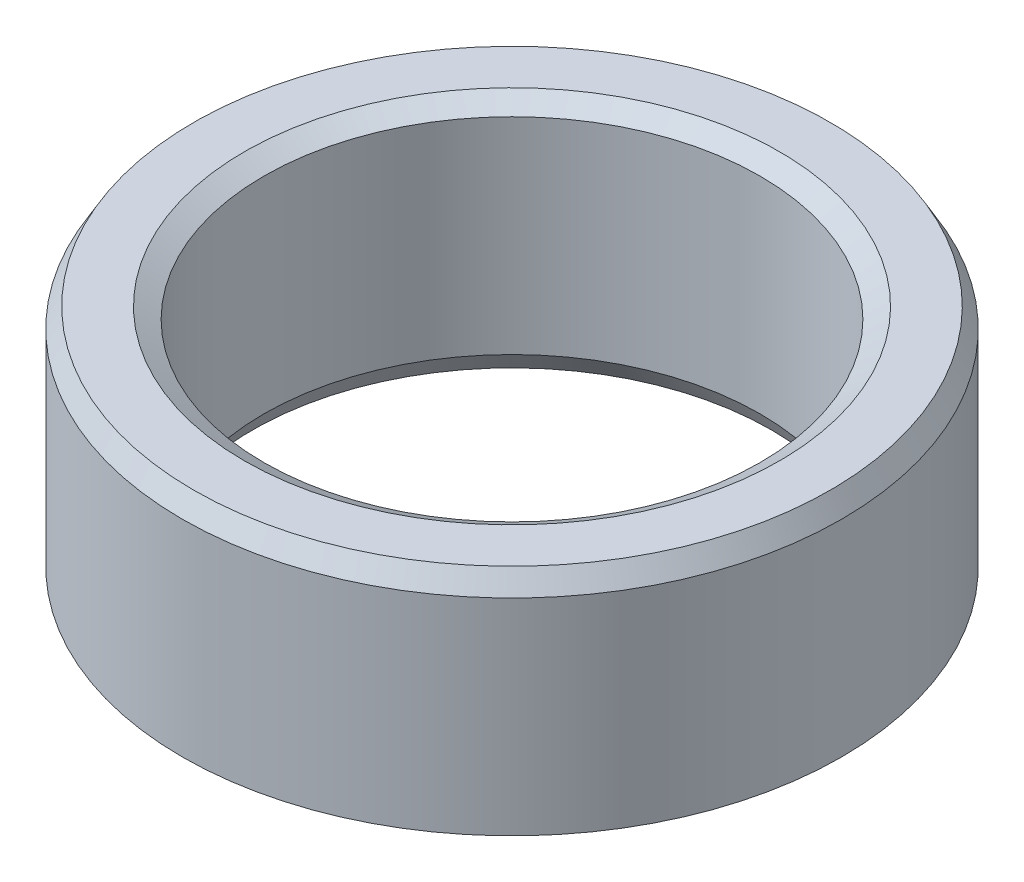
ISO-10303-21;
HEADER;
FILE_DESCRIPTION(('STEP AP214'),'2;1');
FILE_NAME('part.step','',(''),(''),'','','');
FILE_SCHEMA(('AUTOMOTIVE_DESIGN { 1 0 10303 214 1 1 1 1 }'));
ENDSEC;
DATA;
#1=APPLICATION_CONTEXT('core data for automotive mechanical design processes');
#2=APPLICATION_PROTOCOL_DEFINITION('international standard','automotive_design',2000,#1);
#3=PRODUCT_CONTEXT('',#1,'mechanical');
#4=PRODUCT('Part','Part','',(#3));
#5=PRODUCT_RELATED_PRODUCT_CATEGORY('part','',(#4));
#6=PRODUCT_DEFINITION_FORMATION('','',#4);
#7=PRODUCT_DEFINITION_CONTEXT('part definition',#1,'design');
#8=PRODUCT_DEFINITION('design','',#6,#7);
#9=PRODUCT_DEFINITION_SHAPE('','',#8);
#10=(LENGTH_UNIT() NAMED_UNIT(*) SI_UNIT(.MILLI.,.METRE.));
#11=(NAMED_UNIT(*) PLANE_ANGLE_UNIT() SI_UNIT($,.RADIAN.));
#12=(NAMED_UNIT(*) SI_UNIT($,.STERADIAN.) SOLID_ANGLE_UNIT());
#13=UNCERTAINTY_MEASURE_WITH_UNIT(LENGTH_MEASURE(1.E-05),#10,'distance_accuracy_value','');
#14=(GEOMETRIC_REPRESENTATION_CONTEXT(3) GLOBAL_UNCERTAINTY_ASSIGNED_CONTEXT((#13)) GLOBAL_UNIT_ASSIGNED_CONTEXT((#10,
#11,#12)) REPRESENTATION_CONTEXT('',''));
#15=CARTESIAN_POINT('',(0.,0.,0.));
#16=DIRECTION('',(0.,0.,1.));
#17=DIRECTION('',(1.,0.,0.));
#18=AXIS2_PLACEMENT_3D('',#15,#16,#17);
#19=CARTESIAN_POINT('',(0.,28.7259311377696,0.));
#20=DIRECTION('',(0.,-1.,0.));
#21=DIRECTION('',(0.,0.,-1.));
#22=AXIS2_PLACEMENT_3D('',#19,#20,#21);
#23=CYLINDRICAL_SURFACE('',#22,40.);
#24=CARTESIAN_POINT('',(0.,1.36964501173693,0.));
#25=DIRECTION('',(0.,1.,0.));
#26=DIRECTION('',(0.,0.,1.));
#27=AXIS2_PLACEMENT_3D('',#24,#25,#26);
#28=CIRCLE('',#27,40.);
#29=CARTESIAN_POINT('',(0.,1.36964501173693,40.));
#30=VERTEX_POINT('',#29);
#31=EDGE_CURVE('E10',#30,#30,#28,.T.);
#32=ORIENTED_EDGE('',*,*,#31,.T.);
#33=EDGE_LOOP('',(#32));
#34=FACE_BOUND('',#33,.T.);
#35=CARTESIAN_POINT('',(0.,26.3536363891079,0.));
#36=DIRECTION('',(0.,1.,0.));
#37=DIRECTION('',(0.,0.,1.));
#38=AXIS2_PLACEMENT_3D('',#35,#36,#37);
#39=CIRCLE('',#38,40.);
#40=CARTESIAN_POINT('',(0.,26.3536363891079,40.));
#41=VERTEX_POINT('',#40);
#42=EDGE_CURVE('E50',#41,#41,#39,.F.);
#43=ORIENTED_EDGE('',*,*,#42,.T.);
#44=EDGE_LOOP('',(#43));
#45=FACE_BOUND('',#44,.T.);
#46=ADVANCED_FACE('F39',(#34,#45),#23,.T.);
#47=CARTESIAN_POINT('',(0.,28.7259311377696,0.));
#48=DIRECTION('',(0.,1.,0.));
#49=DIRECTION('',(0.,0.,1.));
#50=AXIS2_PLACEMENT_3D('',#47,#48,#49);
#51=PLANE('',#50);
#52=CARTESIAN_POINT('',(0.,28.7259311377696,0.));
#53=DIRECTION('',(0.,1.,0.));
#54=DIRECTION('',(0.,0.,1.));
#55=AXIS2_PLACEMENT_3D('',#52,#53,#54);
#56=CIRCLE('',#55,32.4754508184925);
#57=CARTESIAN_POINT('',(0.,28.7259311377696,32.4754508184925));
#58=VERTEX_POINT('',#57);
#59=EDGE_CURVE('E58',#58,#58,#56,.F.);
#60=ORIENTED_EDGE('',*,*,#59,.T.);
#61=EDGE_LOOP('',(#60));
#62=FACE_BOUND('',#61,.T.);
#63=CARTESIAN_POINT('',(0.,28.7259311377696,0.));
#64=DIRECTION('',(0.,1.,0.));
#65=DIRECTION('',(0.,0.,1.));
#66=AXIS2_PLACEMENT_3D('',#63,#64,#65);
#67=CIRCLE('',#66,38.6303549882631);
#68=CARTESIAN_POINT('',(0.,28.7259311377696,38.6303549882631));
#69=VERTEX_POINT('',#68);
#70=EDGE_CURVE('E61',#69,#69,#67,.T.);
#71=ORIENTED_EDGE('',*,*,#70,.T.);
#72=EDGE_LOOP('',(#71));
#73=FACE_BOUND('',#72,.T.);
#74=ADVANCED_FACE('F88',(#62,#73),#51,.T.);
#75=CARTESIAN_POINT('',(0.,0.,0.));
#76=DIRECTION('',(0.,1.,0.));
#77=DIRECTION('',(0.,0.,1.));
#78=AXIS2_PLACEMENT_3D('',#75,#76,#77);
#79=PLANE('',#78);
#80=CARTESIAN_POINT('',(0.,0.,0.));
#81=DIRECTION('',(0.,1.,0.));
#82=DIRECTION('',(0.,0.,1.));
#83=AXIS2_PLACEMENT_3D('',#80,#81,#82);
#84=CIRCLE('',#83,31.4728010815678);
#85=CARTESIAN_POINT('',(0.,0.,31.4728010815678));
#86=VERTEX_POINT('',#85);
#87=EDGE_CURVE('E51',#86,#86,#84,.T.);
#88=ORIENTED_EDGE('',*,*,#87,.T.);
#89=EDGE_LOOP('',(#88));
#90=FACE_BOUND('',#89,.T.);
#91=CARTESIAN_POINT('',(0.,0.,0.));
#92=DIRECTION('',(0.,1.,0.));
#93=DIRECTION('',(0.,0.,1.));
#94=AXIS2_PLACEMENT_3D('',#91,#92,#93);
#95=CIRCLE('',#94,37.6277052513383);
#96=CARTESIAN_POINT('',(0.,0.,37.6277052513383));
#97=VERTEX_POINT('',#96);
#98=EDGE_CURVE('E54',#97,#97,#95,.F.);
#99=ORIENTED_EDGE('',*,*,#98,.T.);
#100=EDGE_LOOP('',(#99));
#101=FACE_BOUND('',#100,.T.);
#102=ADVANCED_FACE('F83',(#90,#101),#79,.F.);
#103=CARTESIAN_POINT('',(0.,28.7259311377696,0.));
#104=DIRECTION('',(0.,-1.,0.));
#105=DIRECTION('',(0.,0.,-1.));
#106=AXIS2_PLACEMENT_3D('',#103,#104,#105);
#107=CYLINDRICAL_SURFACE('',#106,30.1031560698308);
#108=CARTESIAN_POINT('',(0.,27.3562861260326,0.));
#109=DIRECTION('',(0.,1.,0.));
#110=DIRECTION('',(0.,0.,1.));
#111=AXIS2_PLACEMENT_3D('',#108,#109,#110);
#112=CIRCLE('',#111,30.1031560698308);
#113=CARTESIAN_POINT('',(0.,27.3562861260326,30.1031560698308));
#114=VERTEX_POINT('',#113);
#115=EDGE_CURVE('E67',#114,#114,#112,.T.);
#116=ORIENTED_EDGE('',*,*,#115,.T.);
#117=EDGE_LOOP('',(#116));
#118=FACE_BOUND('',#117,.T.);
#119=CARTESIAN_POINT('',(0.,2.37229474866171,0.));
#120=DIRECTION('',(0.,1.,0.));
#121=DIRECTION('',(0.,0.,1.));
#122=AXIS2_PLACEMENT_3D('',#119,#120,#121);
#123=CIRCLE('',#122,30.1031560698308);
#124=CARTESIAN_POINT('',(0.,2.37229474866171,30.1031560698308));
#125=VERTEX_POINT('',#124);
#126=EDGE_CURVE('E69',#125,#125,#123,.F.);
#127=ORIENTED_EDGE('',*,*,#126,.T.);
#128=EDGE_LOOP('',(#127));
#129=FACE_BOUND('',#128,.T.);
#130=ADVANCED_FACE('F71',(#118,#129),#107,.F.);
#131=CARTESIAN_POINT('',(0.,27.3562861260326,0.));
#132=DIRECTION('',(0.,1.,0.));
#133=DIRECTION('',(0.,0.,1.));
#134=AXIS2_PLACEMENT_3D('',#131,#132,#133);
#135=CONICAL_SURFACE('',#134,30.1031560698308,1.0471975511966);
#136=CARTESIAN_POINT('',(0.,28.7259311377696,32.4754508184925));
#137=CARTESIAN_POINT('',(0.,28.7116640022307,32.4507394148606));
#138=CARTESIAN_POINT('',(0.,28.6973968666918,32.4260280112288));
#139=CARTESIAN_POINT('',(0.,28.6688625956139,32.376605203965));
#140=CARTESIAN_POINT('',(0.,28.654595460075,32.3518938003331));
#141=CARTESIAN_POINT('',(0.,28.6260611889971,32.3024709930693));
#142=CARTESIAN_POINT('',(0.,28.6117940534582,32.2777595894374));
#143=CARTESIAN_POINT('',(0.,28.5832597823803,32.2283367821736));
#144=CARTESIAN_POINT('',(0.,28.5689926468414,32.2036253785417));
#145=CARTESIAN_POINT('',(0.,28.5404583757636,32.1542025712779));
#146=CARTESIAN_POINT('',(0.,28.5261912402246,32.129491167646));
#147=CARTESIAN_POINT('',(0.,28.4976569691468,32.0800683603822));
#148=CARTESIAN_POINT('',(0.,28.4833898336079,32.0553569567504));
#149=CARTESIAN_POINT('',(0.,28.45485556253,32.0059341494866));
#150=CARTESIAN_POINT('',(0.,28.4405884269911,31.9812227458547));
#151=CARTESIAN_POINT('',(0.,28.4120541559132,31.9317999385909));
#152=CARTESIAN_POINT('',(0.,28.3977870203743,31.907088534959));
#153=CARTESIAN_POINT('',(0.,28.3692527492964,31.8576657276952));
#154=CARTESIAN_POINT('',(0.,28.3549856137575,31.8329543240633));
#155=CARTESIAN_POINT('',(0.,28.3264513426797,31.7835315167995));
#156=CARTESIAN_POINT('',(0.,28.3121842071407,31.7588201131676));
#157=CARTESIAN_POINT('',(0.,28.2836499360629,31.7093973059039));
#158=CARTESIAN_POINT('',(0.,28.269382800524,31.684685902272));
#159=CARTESIAN_POINT('',(0.,28.2408485294461,31.6352630950082));
#160=CARTESIAN_POINT('',(0.,28.2265813939072,31.6105516913763));
#161=CARTESIAN_POINT('',(0.,28.1980471228293,31.5611288841125));
#162=CARTESIAN_POINT('',(0.,28.1837799872904,31.5364174804806));
#163=CARTESIAN_POINT('',(0.,28.1552457162125,31.4869946732168));
#164=CARTESIAN_POINT('',(0.,28.1409785806736,31.4622832695849));
#165=CARTESIAN_POINT('',(0.,28.1124443095958,31.4128604623211));
#166=CARTESIAN_POINT('',(0.,28.0981771740568,31.3881490586893));
#167=CARTESIAN_POINT('',(0.,28.069642902979,31.3387262514255));
#168=CARTESIAN_POINT('',(0.,28.0553757674401,31.3140148477936));
#169=CARTESIAN_POINT('',(0.,28.0268414963622,31.2645920405298));
#170=CARTESIAN_POINT('',(0.,28.0125743608233,31.2398806368979));
#171=CARTESIAN_POINT('',(0.,27.9840400897454,31.1904578296341));
#172=CARTESIAN_POINT('',(0.,27.9697729542065,31.1657464260022));
#173=CARTESIAN_POINT('',(0.,27.9412386831286,31.1163236187384));
#174=CARTESIAN_POINT('',(0.,27.9269715475897,31.0916122151065));
#175=CARTESIAN_POINT('',(0.,27.8984372765119,31.0421894078428));
#176=CARTESIAN_POINT('',(0.,27.8841701409729,31.0174780042109));
#177=CARTESIAN_POINT('',(0.,27.8556358698951,30.9680551969471));
#178=CARTESIAN_POINT('',(0.,27.8413687343562,30.9433437933152));
#179=CARTESIAN_POINT('',(0.,27.8128344632783,30.8939209860514));
#180=CARTESIAN_POINT('',(0.,27.7985673277394,30.8692095824195));
#181=CARTESIAN_POINT('',(0.,27.7700330566615,30.8197867751557));
#182=CARTESIAN_POINT('',(0.,27.7557659211226,30.7950753715238));
#183=CARTESIAN_POINT('',(0.,27.7272316500447,30.74565256426));
#184=CARTESIAN_POINT('',(0.,27.7129645145058,30.7209411606281));
#185=CARTESIAN_POINT('',(0.,27.684430243428,30.6715183533644));
#186=CARTESIAN_POINT('',(0.,27.670163107889,30.6468069497325));
#187=CARTESIAN_POINT('',(0.,27.6416288368112,30.5973841424687));
#188=CARTESIAN_POINT('',(0.,27.6273617012723,30.5726727388368));
#189=CARTESIAN_POINT('',(0.,27.5988274301944,30.523249931573));
#190=CARTESIAN_POINT('',(0.,27.5845602946555,30.4985385279411));
#191=CARTESIAN_POINT('',(0.,27.5560260235776,30.4491157206773));
#192=CARTESIAN_POINT('',(0.,27.5417588880387,30.4244043170454));
#193=CARTESIAN_POINT('',(0.,27.5132246169608,30.3749815097816));
#194=CARTESIAN_POINT('',(0.,27.4989574814219,30.3502701061498));
#195=CARTESIAN_POINT('',(0.,27.4704232103441,30.300847298886));
#196=CARTESIAN_POINT('',(0.,27.4561560748051,30.2761358952541));
#197=CARTESIAN_POINT('',(0.,27.4276218037273,30.2267130879903));
#198=CARTESIAN_POINT('',(0.,27.4133546681884,30.2020016843584));
#199=CARTESIAN_POINT('',(0.,27.3848203971105,30.1525788770946));
#200=CARTESIAN_POINT('',(0.,27.3705532615716,30.1278674734627));
#201=CARTESIAN_POINT('',(0.,27.3562861260326,30.1031560698308));
#202=B_SPLINE_CURVE_WITH_KNOTS('',3,(#136,#137,#138,#139,#140,#141,#142,#143,#144,#145,#146,
#147,#148,#149,#150,#151,#152,#153,#154,#155,#156,#157,#158,#159,#160,#161,#162,#163,#164,#165,
#166,#167,#168,#169,#170,#171,#172,#173,#174,#175,#176,#177,#178,#179,#180,#181,#182,#183,#184,
#185,#186,#187,#188,#189,#190,#191,#192,#193,#194,#195,#196,#197,#198,#199,#200,#201),
.UNSPECIFIED.,.F.,.F.,(4,2,2,2,2,2,2,2,2,2,2,2,2,2,2,2,2,2,2,2,2,2,2,2,2,2,2,2,2,2,2,2,4),(0.,
0.08560281323356,0.171205626467122,0.256808439700683,0.342411252934245,0.428014066167807,
0.513616879401367,0.599219692634923,0.684822505868484,0.770425319102046,0.856028132335608,
0.941630945569168,1.02723375880273,1.11283657203629,1.19843938526985,1.28404219850341,
1.36964501173697,1.45524782497053,1.54085063820409,1.62645345143765,1.71205626467121,
1.79765907790477,1.88326189113833,1.96886470437189,2.05446751760546,2.14007033083902,
2.22567314407258,2.31127595730614,2.3968787705397,2.48248158377326,2.56808439700682,
2.65368721024038,2.73929002347394),.UNSPECIFIED.);
#203=EDGE_CURVE('BSEAM77',#58,#114,#202,.T.);
#204=ORIENTED_EDGE('',*,*,#59,.F.);
#205=ORIENTED_EDGE('',*,*,#115,.F.);
#206=ORIENTED_EDGE('',*,*,#203,.T.);
#207=ORIENTED_EDGE('',*,*,#203,.F.);
#208=EDGE_LOOP('',(#204,#206,#205,#207));
#209=FACE_BOUND('',#208,.T.);
#210=ADVANCED_FACE('F77',(#209),#135,.F.);
#211=CARTESIAN_POINT('',(0.,0.,0.));
#212=DIRECTION('',(0.,-1.,0.));
#213=DIRECTION('',(0.,0.,-1.));
#214=AXIS2_PLACEMENT_3D('',#211,#212,#213);
#215=CONICAL_SURFACE('',#214,31.4728010815678,0.523598775598295);
#216=ORIENTED_EDGE('',*,*,#126,.F.);
#217=EDGE_LOOP('',(#216));
#218=FACE_BOUND('',#217,.T.);
#219=ORIENTED_EDGE('',*,*,#87,.F.);
#220=EDGE_LOOP('',(#219));
#221=FACE_BOUND('',#220,.T.);
#222=ADVANCED_FACE('F73',(#218,#221),#215,.F.);
#223=CARTESIAN_POINT('',(0.,1.36964501173693,0.));
#224=DIRECTION('',(0.,1.,0.));
#225=DIRECTION('',(0.,0.,1.));
#226=AXIS2_PLACEMENT_3D('',#223,#224,#225);
#227=CONICAL_SURFACE('',#226,40.,1.0471975511966);
#228=ORIENTED_EDGE('',*,*,#98,.F.);
#229=EDGE_LOOP('',(#228));
#230=FACE_BOUND('',#229,.T.);
#231=ORIENTED_EDGE('',*,*,#31,.F.);
#232=EDGE_LOOP('',(#231));
#233=FACE_BOUND('',#232,.T.);
#234=ADVANCED_FACE('F76',(#230,#233),#227,.T.);
#235=CARTESIAN_POINT('',(0.,28.7259311377696,0.));
#236=DIRECTION('',(0.,-1.,0.));
#237=DIRECTION('',(0.,0.,-1.));
#238=AXIS2_PLACEMENT_3D('',#235,#236,#237);
#239=CONICAL_SURFACE('',#238,38.6303549882631,0.5235987755983);
#240=ORIENTED_EDGE('',*,*,#42,.F.);
#241=EDGE_LOOP('',(#240));
#242=FACE_BOUND('',#241,.T.);
#243=ORIENTED_EDGE('',*,*,#70,.F.);
#244=EDGE_LOOP('',(#243));
#245=FACE_BOUND('',#244,.T.);
#246=ADVANCED_FACE('F45',(#242,#245),#239,.T.);
#247=CLOSED_SHELL('',(#46,#74,#102,#130,#210,#222,#234,#246));
#248=MANIFOLD_SOLID_BREP('B2',#247);
#249=ADVANCED_BREP_SHAPE_REPRESENTATION('',(#18,#248),#14);
#250=SHAPE_DEFINITION_REPRESENTATION(#9,#249);
ENDSEC;
END-ISO-10303-21;
